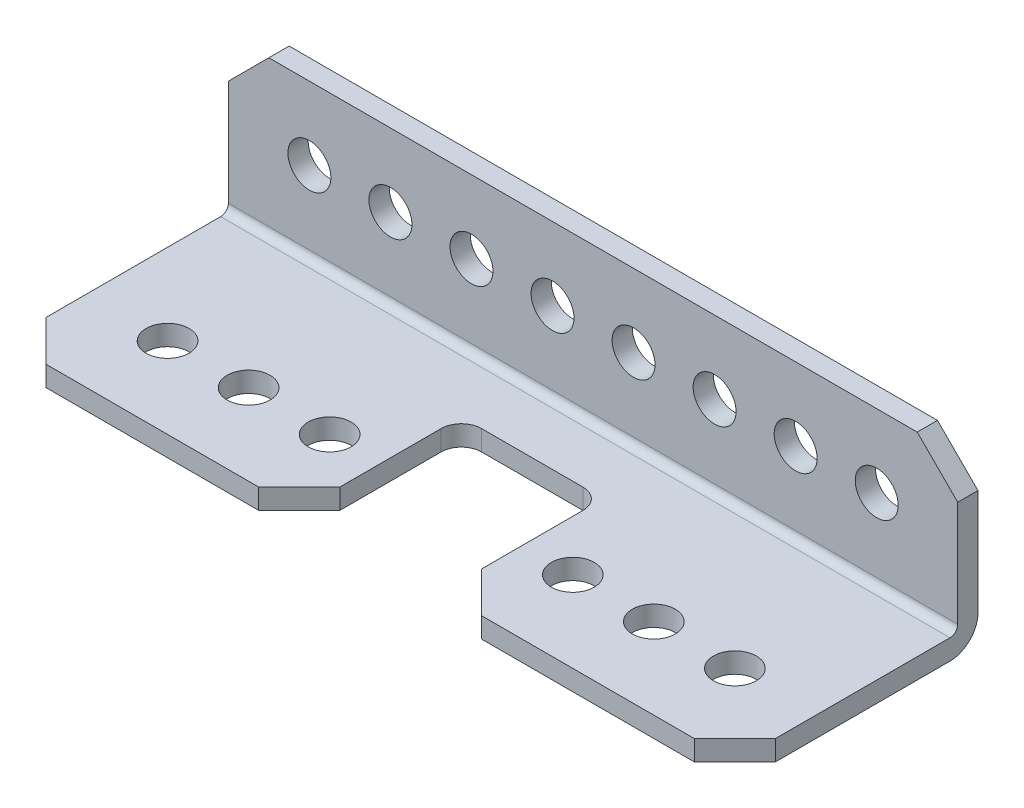
ISO-10303-21;
HEADER;
FILE_DESCRIPTION(('STEP AP214'),'2;1');
FILE_NAME('part.step','',(''),(''),'','','');
FILE_SCHEMA(('AUTOMOTIVE_DESIGN { 1 0 10303 214 1 1 1 1 }'));
ENDSEC;
DATA;
#1=APPLICATION_CONTEXT('core data for automotive mechanical design processes');
#2=APPLICATION_PROTOCOL_DEFINITION('international standard','automotive_design',2000,#1);
#3=PRODUCT_CONTEXT('',#1,'mechanical');
#4=PRODUCT('Part','Part','',(#3));
#5=PRODUCT_RELATED_PRODUCT_CATEGORY('part','',(#4));
#6=PRODUCT_DEFINITION_FORMATION('','',#4);
#7=PRODUCT_DEFINITION_CONTEXT('part definition',#1,'design');
#8=PRODUCT_DEFINITION('design','',#6,#7);
#9=PRODUCT_DEFINITION_SHAPE('','',#8);
#10=(LENGTH_UNIT() NAMED_UNIT(*) SI_UNIT(.MILLI.,.METRE.));
#11=(NAMED_UNIT(*) PLANE_ANGLE_UNIT() SI_UNIT($,.RADIAN.));
#12=(NAMED_UNIT(*) SI_UNIT($,.STERADIAN.) SOLID_ANGLE_UNIT());
#13=UNCERTAINTY_MEASURE_WITH_UNIT(LENGTH_MEASURE(1.E-05),#10,'distance_accuracy_value','');
#14=(GEOMETRIC_REPRESENTATION_CONTEXT(3) GLOBAL_UNCERTAINTY_ASSIGNED_CONTEXT((#13)) GLOBAL_UNIT_ASSIGNED_CONTEXT((#10,
#11,#12)) REPRESENTATION_CONTEXT('',''));
#15=CARTESIAN_POINT('',(0.,0.,0.));
#16=DIRECTION('',(0.,0.,1.));
#17=DIRECTION('',(1.,0.,0.));
#18=AXIS2_PLACEMENT_3D('',#15,#16,#17);
#19=CARTESIAN_POINT('',(-57.15,-12.065,0.));
#20=DIRECTION('',(0.,0.,1.));
#21=DIRECTION('',(1.,0.,0.));
#22=AXIS2_PLACEMENT_3D('',#19,#20,#21);
#23=PLANE('',#22);
#24=DIRECTION('',(0.707106781186548,-0.707106781186547,0.));
#25=VECTOR('',#24,1.);
#26=CARTESIAN_POINT('',(50.8,12.065,0.));
#27=LINE('',#26,#25);
#28=CARTESIAN_POINT('',(50.8,12.065,0.));
#29=VERTEX_POINT('',#28);
#30=CARTESIAN_POINT('',(57.15,5.71500000000001,0.));
#31=VERTEX_POINT('',#30);
#32=EDGE_CURVE('E155',#29,#31,#27,.T.);
#33=ORIENTED_EDGE('',*,*,#32,.T.);
#34=DIRECTION('',(0.,1.,0.));
#35=VECTOR('',#34,1.);
#36=CARTESIAN_POINT('',(57.15,12.065,0.));
#37=LINE('',#36,#35);
#38=CARTESIAN_POINT('',(57.15,-10.8458,0.));
#39=VERTEX_POINT('',#38);
#40=EDGE_CURVE('E149',#31,#39,#37,.F.);
#41=ORIENTED_EDGE('',*,*,#40,.T.);
#42=DIRECTION('',(1.,0.,0.));
#43=VECTOR('',#42,1.);
#44=CARTESIAN_POINT('',(57.15,-10.8458,0.));
#45=LINE('',#44,#43);
#46=CARTESIAN_POINT('',(-57.15,-10.8458,0.));
#47=VERTEX_POINT('',#46);
#48=EDGE_CURVE('E152',#47,#39,#45,.T.);
#49=ORIENTED_EDGE('',*,*,#48,.F.);
#50=DIRECTION('',(0.,1.,0.));
#51=VECTOR('',#50,1.);
#52=CARTESIAN_POINT('',(-57.15,12.065,0.));
#53=LINE('',#52,#51);
#54=CARTESIAN_POINT('',(-57.15,5.715,0.));
#55=VERTEX_POINT('',#54);
#56=EDGE_CURVE('E473',#47,#55,#53,.T.);
#57=ORIENTED_EDGE('',*,*,#56,.T.);
#58=DIRECTION('',(0.707106781186548,0.707106781186547,0.));
#59=VECTOR('',#58,1.);
#60=CARTESIAN_POINT('',(-57.15,5.715,0.));
#61=LINE('',#60,#59);
#62=CARTESIAN_POINT('',(-50.8,12.065,0.));
#63=VERTEX_POINT('',#62);
#64=EDGE_CURVE('E448',#55,#63,#61,.T.);
#65=ORIENTED_EDGE('',*,*,#64,.T.);
#66=DIRECTION('',(1.,0.,0.));
#67=VECTOR('',#66,1.);
#68=CARTESIAN_POINT('',(-57.15,12.065,0.));
#69=LINE('',#68,#67);
#70=EDGE_CURVE('E443',#63,#29,#69,.T.);
#71=ORIENTED_EDGE('',*,*,#70,.T.);
#72=EDGE_LOOP('',(#33,#41,#49,#57,#65,#71));
#73=FACE_BOUND('',#72,.T.);
#74=CARTESIAN_POINT('',(-44.45,0.634999999999998,0.));
#75=DIRECTION('',(0.,0.,1.));
#76=DIRECTION('',(1.,0.,0.));
#77=AXIS2_PLACEMENT_3D('',#74,#75,#76);
#78=CIRCLE('',#77,3.3655);
#79=CARTESIAN_POINT('',(-41.0845,0.634999999999998,0.));
#80=VERTEX_POINT('',#79);
#81=EDGE_CURVE('E159',#80,#80,#78,.T.);
#82=ORIENTED_EDGE('',*,*,#81,.T.);
#83=EDGE_LOOP('',(#82));
#84=FACE_BOUND('',#83,.T.);
#85=CARTESIAN_POINT('',(-31.75,0.634999999999998,0.));
#86=DIRECTION('',(0.,0.,1.));
#87=DIRECTION('',(1.,0.,0.));
#88=AXIS2_PLACEMENT_3D('',#85,#86,#87);
#89=CIRCLE('',#88,3.36549999999999);
#90=CARTESIAN_POINT('',(-28.3845,0.634999999999998,0.));
#91=VERTEX_POINT('',#90);
#92=EDGE_CURVE('E184',#91,#91,#89,.T.);
#93=ORIENTED_EDGE('',*,*,#92,.T.);
#94=EDGE_LOOP('',(#93));
#95=FACE_BOUND('',#94,.T.);
#96=CARTESIAN_POINT('',(-19.05,0.634999999999998,0.));
#97=DIRECTION('',(0.,0.,1.));
#98=DIRECTION('',(1.,0.,0.));
#99=AXIS2_PLACEMENT_3D('',#96,#97,#98);
#100=CIRCLE('',#99,3.3655);
#101=CARTESIAN_POINT('',(-15.6845,0.634999999999998,0.));
#102=VERTEX_POINT('',#101);
#103=EDGE_CURVE('E187',#102,#102,#100,.T.);
#104=ORIENTED_EDGE('',*,*,#103,.T.);
#105=EDGE_LOOP('',(#104));
#106=FACE_BOUND('',#105,.T.);
#107=CARTESIAN_POINT('',(-6.35,0.634999999999998,0.));
#108=DIRECTION('',(0.,0.,1.));
#109=DIRECTION('',(1.,0.,0.));
#110=AXIS2_PLACEMENT_3D('',#107,#108,#109);
#111=CIRCLE('',#110,3.3655);
#112=CARTESIAN_POINT('',(-2.9845,0.634999999999998,0.));
#113=VERTEX_POINT('',#112);
#114=EDGE_CURVE('E190',#113,#113,#111,.T.);
#115=ORIENTED_EDGE('',*,*,#114,.T.);
#116=EDGE_LOOP('',(#115));
#117=FACE_BOUND('',#116,.T.);
#118=CARTESIAN_POINT('',(6.35,0.634999999999998,0.));
#119=DIRECTION('',(0.,0.,1.));
#120=DIRECTION('',(1.,0.,0.));
#121=AXIS2_PLACEMENT_3D('',#118,#119,#120);
#122=CIRCLE('',#121,3.3655);
#123=CARTESIAN_POINT('',(9.7155,0.634999999999998,0.));
#124=VERTEX_POINT('',#123);
#125=EDGE_CURVE('E193',#124,#124,#122,.T.);
#126=ORIENTED_EDGE('',*,*,#125,.T.);
#127=EDGE_LOOP('',(#126));
#128=FACE_BOUND('',#127,.T.);
#129=CARTESIAN_POINT('',(19.05,0.634999999999998,0.));
#130=DIRECTION('',(0.,0.,1.));
#131=DIRECTION('',(1.,0.,0.));
#132=AXIS2_PLACEMENT_3D('',#129,#130,#131);
#133=CIRCLE('',#132,3.3655);
#134=CARTESIAN_POINT('',(22.4155,0.634999999999998,0.));
#135=VERTEX_POINT('',#134);
#136=EDGE_CURVE('E196',#135,#135,#133,.T.);
#137=ORIENTED_EDGE('',*,*,#136,.T.);
#138=EDGE_LOOP('',(#137));
#139=FACE_BOUND('',#138,.T.);
#140=CARTESIAN_POINT('',(31.75,0.634999999999998,0.));
#141=DIRECTION('',(0.,0.,1.));
#142=DIRECTION('',(1.,0.,0.));
#143=AXIS2_PLACEMENT_3D('',#140,#141,#142);
#144=CIRCLE('',#143,3.3655);
#145=CARTESIAN_POINT('',(35.1155,0.634999999999998,0.));
#146=VERTEX_POINT('',#145);
#147=EDGE_CURVE('E198',#146,#146,#144,.T.);
#148=ORIENTED_EDGE('',*,*,#147,.T.);
#149=EDGE_LOOP('',(#148));
#150=FACE_BOUND('',#149,.T.);
#151=CARTESIAN_POINT('',(44.45,0.634999999999998,0.));
#152=DIRECTION('',(0.,0.,1.));
#153=DIRECTION('',(1.,0.,0.));
#154=AXIS2_PLACEMENT_3D('',#151,#152,#153);
#155=CIRCLE('',#154,3.3655);
#156=CARTESIAN_POINT('',(47.8155,0.634999999999998,0.));
#157=VERTEX_POINT('',#156);
#158=EDGE_CURVE('E19',#157,#157,#155,.T.);
#159=ORIENTED_EDGE('',*,*,#158,.T.);
#160=EDGE_LOOP('',(#159));
#161=FACE_BOUND('',#160,.T.);
#162=ADVANCED_FACE('F16',(#73,#84,#95,#106,#117,#128,#139,#150,#161),#23,.F.);
#163=CARTESIAN_POINT('',(44.45,0.634999999999998,0.));
#164=DIRECTION('',(0.,0.,1.));
#165=DIRECTION('',(1.,0.,0.));
#166=AXIS2_PLACEMENT_3D('',#163,#164,#165);
#167=CYLINDRICAL_SURFACE('',#166,3.3655);
#168=CARTESIAN_POINT('',(44.45,0.634999999999998,3.175));
#169=DIRECTION('',(0.,0.,1.));
#170=DIRECTION('',(1.,0.,0.));
#171=AXIS2_PLACEMENT_3D('',#168,#169,#170);
#172=CIRCLE('',#171,3.3655);
#173=CARTESIAN_POINT('',(47.8155,0.634999999999998,3.175));
#174=VERTEX_POINT('',#173);
#175=EDGE_CURVE('E175',#174,#174,#172,.F.);
#176=ORIENTED_EDGE('',*,*,#175,.F.);
#177=EDGE_LOOP('',(#176));
#178=FACE_BOUND('',#177,.T.);
#179=ORIENTED_EDGE('',*,*,#158,.F.);
#180=EDGE_LOOP('',(#179));
#181=FACE_BOUND('',#180,.T.);
#182=ADVANCED_FACE('F206',(#178,#181),#167,.F.);
#183=CARTESIAN_POINT('',(31.75,0.634999999999998,0.));
#184=DIRECTION('',(0.,0.,1.));
#185=DIRECTION('',(1.,0.,0.));
#186=AXIS2_PLACEMENT_3D('',#183,#184,#185);
#187=CYLINDRICAL_SURFACE('',#186,3.3655);
#188=CARTESIAN_POINT('',(31.75,0.634999999999998,3.175));
#189=DIRECTION('',(0.,0.,1.));
#190=DIRECTION('',(1.,0.,0.));
#191=AXIS2_PLACEMENT_3D('',#188,#189,#190);
#192=CIRCLE('',#191,3.3655);
#193=CARTESIAN_POINT('',(35.1155,0.634999999999998,3.175));
#194=VERTEX_POINT('',#193);
#195=EDGE_CURVE('E178',#194,#194,#192,.F.);
#196=ORIENTED_EDGE('',*,*,#195,.F.);
#197=EDGE_LOOP('',(#196));
#198=FACE_BOUND('',#197,.T.);
#199=ORIENTED_EDGE('',*,*,#147,.F.);
#200=EDGE_LOOP('',(#199));
#201=FACE_BOUND('',#200,.T.);
#202=ADVANCED_FACE('F208',(#198,#201),#187,.F.);
#203=CARTESIAN_POINT('',(19.05,0.634999999999998,0.));
#204=DIRECTION('',(0.,0.,1.));
#205=DIRECTION('',(1.,0.,0.));
#206=AXIS2_PLACEMENT_3D('',#203,#204,#205);
#207=CYLINDRICAL_SURFACE('',#206,3.3655);
#208=CARTESIAN_POINT('',(19.05,0.634999999999998,3.175));
#209=DIRECTION('',(0.,0.,1.));
#210=DIRECTION('',(1.,0.,0.));
#211=AXIS2_PLACEMENT_3D('',#208,#209,#210);
#212=CIRCLE('',#211,3.3655);
#213=CARTESIAN_POINT('',(22.4155,0.634999999999998,3.175));
#214=VERTEX_POINT('',#213);
#215=EDGE_CURVE('E353',#214,#214,#212,.F.);
#216=ORIENTED_EDGE('',*,*,#215,.F.);
#217=EDGE_LOOP('',(#216));
#218=FACE_BOUND('',#217,.T.);
#219=ORIENTED_EDGE('',*,*,#136,.F.);
#220=EDGE_LOOP('',(#219));
#221=FACE_BOUND('',#220,.T.);
#222=ADVANCED_FACE('F215',(#218,#221),#207,.F.);
#223=CARTESIAN_POINT('',(6.35,0.634999999999998,0.));
#224=DIRECTION('',(0.,0.,1.));
#225=DIRECTION('',(1.,0.,0.));
#226=AXIS2_PLACEMENT_3D('',#223,#224,#225);
#227=CYLINDRICAL_SURFACE('',#226,3.3655);
#228=CARTESIAN_POINT('',(6.35,0.634999999999998,3.175));
#229=DIRECTION('',(0.,0.,1.));
#230=DIRECTION('',(1.,0.,0.));
#231=AXIS2_PLACEMENT_3D('',#228,#229,#230);
#232=CIRCLE('',#231,3.3655);
#233=CARTESIAN_POINT('',(9.7155,0.634999999999998,3.175));
#234=VERTEX_POINT('',#233);
#235=EDGE_CURVE('E357',#234,#234,#232,.F.);
#236=ORIENTED_EDGE('',*,*,#235,.F.);
#237=EDGE_LOOP('',(#236));
#238=FACE_BOUND('',#237,.T.);
#239=ORIENTED_EDGE('',*,*,#125,.F.);
#240=EDGE_LOOP('',(#239));
#241=FACE_BOUND('',#240,.T.);
#242=ADVANCED_FACE('F341',(#238,#241),#227,.F.);
#243=CARTESIAN_POINT('',(-6.35,0.634999999999998,0.));
#244=DIRECTION('',(0.,0.,1.));
#245=DIRECTION('',(1.,0.,0.));
#246=AXIS2_PLACEMENT_3D('',#243,#244,#245);
#247=CYLINDRICAL_SURFACE('',#246,3.3655);
#248=CARTESIAN_POINT('',(-6.35,0.634999999999998,3.175));
#249=DIRECTION('',(0.,0.,1.));
#250=DIRECTION('',(1.,0.,0.));
#251=AXIS2_PLACEMENT_3D('',#248,#249,#250);
#252=CIRCLE('',#251,3.3655);
#253=CARTESIAN_POINT('',(-2.9845,0.634999999999998,3.175));
#254=VERTEX_POINT('',#253);
#255=EDGE_CURVE('E360',#254,#254,#252,.F.);
#256=ORIENTED_EDGE('',*,*,#255,.F.);
#257=EDGE_LOOP('',(#256));
#258=FACE_BOUND('',#257,.T.);
#259=ORIENTED_EDGE('',*,*,#114,.F.);
#260=EDGE_LOOP('',(#259));
#261=FACE_BOUND('',#260,.T.);
#262=ADVANCED_FACE('F337',(#258,#261),#247,.F.);
#263=CARTESIAN_POINT('',(-19.05,0.634999999999998,0.));
#264=DIRECTION('',(0.,0.,1.));
#265=DIRECTION('',(1.,0.,0.));
#266=AXIS2_PLACEMENT_3D('',#263,#264,#265);
#267=CYLINDRICAL_SURFACE('',#266,3.3655);
#268=CARTESIAN_POINT('',(-19.05,0.634999999999998,3.175));
#269=DIRECTION('',(0.,0.,1.));
#270=DIRECTION('',(1.,0.,0.));
#271=AXIS2_PLACEMENT_3D('',#268,#269,#270);
#272=CIRCLE('',#271,3.3655);
#273=CARTESIAN_POINT('',(-15.6845,0.634999999999998,3.175));
#274=VERTEX_POINT('',#273);
#275=EDGE_CURVE('E366',#274,#274,#272,.F.);
#276=ORIENTED_EDGE('',*,*,#275,.F.);
#277=EDGE_LOOP('',(#276));
#278=FACE_BOUND('',#277,.T.);
#279=ORIENTED_EDGE('',*,*,#103,.F.);
#280=EDGE_LOOP('',(#279));
#281=FACE_BOUND('',#280,.T.);
#282=ADVANCED_FACE('F333',(#278,#281),#267,.F.);
#283=CARTESIAN_POINT('',(-31.75,0.634999999999998,0.));
#284=DIRECTION('',(0.,0.,1.));
#285=DIRECTION('',(1.,0.,0.));
#286=AXIS2_PLACEMENT_3D('',#283,#284,#285);
#287=CYLINDRICAL_SURFACE('',#286,3.36549999999999);
#288=CARTESIAN_POINT('',(-31.75,0.634999999999998,3.175));
#289=DIRECTION('',(0.,0.,1.));
#290=DIRECTION('',(1.,0.,0.));
#291=AXIS2_PLACEMENT_3D('',#288,#289,#290);
#292=CIRCLE('',#291,3.36549999999999);
#293=CARTESIAN_POINT('',(-28.3845,0.634999999999998,3.175));
#294=VERTEX_POINT('',#293);
#295=EDGE_CURVE('E369',#294,#294,#292,.F.);
#296=ORIENTED_EDGE('',*,*,#295,.F.);
#297=EDGE_LOOP('',(#296));
#298=FACE_BOUND('',#297,.T.);
#299=ORIENTED_EDGE('',*,*,#92,.F.);
#300=EDGE_LOOP('',(#299));
#301=FACE_BOUND('',#300,.T.);
#302=ADVANCED_FACE('F329',(#298,#301),#287,.F.);
#303=CARTESIAN_POINT('',(-44.45,0.634999999999998,0.));
#304=DIRECTION('',(0.,0.,1.));
#305=DIRECTION('',(1.,0.,0.));
#306=AXIS2_PLACEMENT_3D('',#303,#304,#305);
#307=CYLINDRICAL_SURFACE('',#306,3.3655);
#308=CARTESIAN_POINT('',(-44.45,0.634999999999998,3.175));
#309=DIRECTION('',(0.,0.,1.));
#310=DIRECTION('',(1.,0.,0.));
#311=AXIS2_PLACEMENT_3D('',#308,#309,#310);
#312=CIRCLE('',#311,3.3655);
#313=CARTESIAN_POINT('',(-41.0845,0.634999999999998,3.175));
#314=VERTEX_POINT('',#313);
#315=EDGE_CURVE('E372',#314,#314,#312,.F.);
#316=ORIENTED_EDGE('',*,*,#315,.F.);
#317=EDGE_LOOP('',(#316));
#318=FACE_BOUND('',#317,.T.);
#319=ORIENTED_EDGE('',*,*,#81,.F.);
#320=EDGE_LOOP('',(#319));
#321=FACE_BOUND('',#320,.T.);
#322=ADVANCED_FACE('F325',(#318,#321),#307,.F.);
#323=CARTESIAN_POINT('',(50.8,12.065,3.175));
#324=DIRECTION('',(-0.707106781186547,-0.707106781186548,0.));
#325=DIRECTION('',(0.707106781186548,-0.707106781186547,0.));
#326=AXIS2_PLACEMENT_3D('',#323,#324,#325);
#327=PLANE('',#326);
#328=DIRECTION('',(0.,0.,1.));
#329=VECTOR('',#328,1.);
#330=CARTESIAN_POINT('',(57.15,5.715,3.175));
#331=LINE('',#330,#329);
#332=CARTESIAN_POINT('',(57.15,5.715,3.175));
#333=VERTEX_POINT('',#332);
#334=EDGE_CURVE('E440',#31,#333,#331,.T.);
#335=ORIENTED_EDGE('',*,*,#334,.F.);
#336=ORIENTED_EDGE('',*,*,#32,.F.);
#337=DIRECTION('',(0.,0.,-1.));
#338=VECTOR('',#337,1.);
#339=CARTESIAN_POINT('',(50.8,12.065,3.175));
#340=LINE('',#339,#338);
#341=CARTESIAN_POINT('',(50.8,12.065,3.175));
#342=VERTEX_POINT('',#341);
#343=EDGE_CURVE('E445',#29,#342,#340,.F.);
#344=ORIENTED_EDGE('',*,*,#343,.T.);
#345=DIRECTION('',(-0.707106781186548,0.707106781186547,0.));
#346=VECTOR('',#345,1.);
#347=CARTESIAN_POINT('',(57.15,5.71500000000001,3.175));
#348=LINE('',#347,#346);
#349=EDGE_CURVE('E458',#333,#342,#348,.T.);
#350=ORIENTED_EDGE('',*,*,#349,.F.);
#351=EDGE_LOOP('',(#335,#336,#344,#350));
#352=FACE_BOUND('',#351,.T.);
#353=ADVANCED_FACE('F321',(#352),#327,.F.);
#354=CARTESIAN_POINT('',(-57.15,12.065,3.175));
#355=DIRECTION('',(0.,-1.,0.));
#356=DIRECTION('',(0.,0.,-1.));
#357=AXIS2_PLACEMENT_3D('',#354,#355,#356);
#358=PLANE('',#357);
#359=ORIENTED_EDGE('',*,*,#343,.F.);
#360=ORIENTED_EDGE('',*,*,#70,.F.);
#361=DIRECTION('',(0.,0.,1.));
#362=VECTOR('',#361,1.);
#363=CARTESIAN_POINT('',(-50.8,12.065,3.175));
#364=LINE('',#363,#362);
#365=CARTESIAN_POINT('',(-50.8,12.065,3.175));
#366=VERTEX_POINT('',#365);
#367=EDGE_CURVE('E450',#63,#366,#364,.T.);
#368=ORIENTED_EDGE('',*,*,#367,.T.);
#369=DIRECTION('',(1.,0.,0.));
#370=VECTOR('',#369,1.);
#371=CARTESIAN_POINT('',(-57.15,12.065,3.175));
#372=LINE('',#371,#370);
#373=EDGE_CURVE('E461',#342,#366,#372,.F.);
#374=ORIENTED_EDGE('',*,*,#373,.F.);
#375=EDGE_LOOP('',(#359,#360,#368,#374));
#376=FACE_BOUND('',#375,.T.);
#377=ADVANCED_FACE('F317',(#376),#358,.F.);
#378=CARTESIAN_POINT('',(-57.15,5.715,3.175));
#379=DIRECTION('',(0.707106781186547,-0.707106781186548,0.));
#380=DIRECTION('',(0.707106781186548,0.707106781186547,0.));
#381=AXIS2_PLACEMENT_3D('',#378,#379,#380);
#382=PLANE('',#381);
#383=ORIENTED_EDGE('',*,*,#367,.F.);
#384=ORIENTED_EDGE('',*,*,#64,.F.);
#385=DIRECTION('',(0.,0.,-1.));
#386=VECTOR('',#385,1.);
#387=CARTESIAN_POINT('',(-57.15,5.715,3.175));
#388=LINE('',#387,#386);
#389=CARTESIAN_POINT('',(-57.15,5.715,3.175));
#390=VERTEX_POINT('',#389);
#391=EDGE_CURVE('E169',#55,#390,#388,.F.);
#392=ORIENTED_EDGE('',*,*,#391,.T.);
#393=DIRECTION('',(-0.707106781186548,-0.707106781186547,0.));
#394=VECTOR('',#393,1.);
#395=CARTESIAN_POINT('',(-50.8,12.065,3.175));
#396=LINE('',#395,#394);
#397=EDGE_CURVE('E469',#366,#390,#396,.T.);
#398=ORIENTED_EDGE('',*,*,#397,.F.);
#399=EDGE_LOOP('',(#383,#384,#392,#398));
#400=FACE_BOUND('',#399,.T.);
#401=ADVANCED_FACE('F314',(#400),#382,.F.);
#402=CARTESIAN_POINT('',(57.15,-10.8458,4.3942));
#403=DIRECTION('',(1.,0.,0.));
#404=DIRECTION('',(0.,0.,-1.));
#405=AXIS2_PLACEMENT_3D('',#402,#403,#404);
#406=CYLINDRICAL_SURFACE('',#405,4.3942);
#407=DIRECTION('',(1.,0.,0.));
#408=VECTOR('',#407,1.);
#409=CARTESIAN_POINT('',(-57.15,-15.24,4.39419999999999));
#410=LINE('',#409,#408);
#411=CARTESIAN_POINT('',(57.15,-15.24,4.39419999999999));
#412=VERTEX_POINT('',#411);
#413=CARTESIAN_POINT('',(-57.15,-15.24,4.39419999999999));
#414=VERTEX_POINT('',#413);
#415=EDGE_CURVE('E377',#412,#414,#410,.F.);
#416=ORIENTED_EDGE('',*,*,#415,.T.);
#417=CARTESIAN_POINT('',(-57.15,-10.8458,4.3942));
#418=DIRECTION('',(1.,0.,0.));
#419=DIRECTION('',(0.,0.,-1.));
#420=AXIS2_PLACEMENT_3D('',#417,#418,#419);
#421=CIRCLE('',#420,4.3942);
#422=EDGE_CURVE('E168',#47,#414,#421,.F.);
#423=ORIENTED_EDGE('',*,*,#422,.F.);
#424=ORIENTED_EDGE('',*,*,#48,.T.);
#425=CARTESIAN_POINT('',(57.15,-10.8458,4.3942));
#426=DIRECTION('',(1.,0.,0.));
#427=DIRECTION('',(0.,0.,-1.));
#428=AXIS2_PLACEMENT_3D('',#425,#426,#427);
#429=CIRCLE('',#428,4.3942);
#430=EDGE_CURVE('E165',#39,#412,#429,.F.);
#431=ORIENTED_EDGE('',*,*,#430,.T.);
#432=EDGE_LOOP('',(#416,#423,#424,#431));
#433=FACE_BOUND('',#432,.T.);
#434=ADVANCED_FACE('F164',(#433),#406,.T.);
#435=CARTESIAN_POINT('',(-57.15,-12.065,3.175));
#436=DIRECTION('',(0.,0.,1.));
#437=DIRECTION('',(1.,0.,0.));
#438=AXIS2_PLACEMENT_3D('',#435,#436,#437);
#439=PLANE('',#438);
#440=DIRECTION('',(0.,1.,0.));
#441=VECTOR('',#440,1.);
#442=CARTESIAN_POINT('',(-57.15,-12.065,3.175));
#443=LINE('',#442,#441);
#444=CARTESIAN_POINT('',(-57.15,-10.8458,3.175));
#445=VERTEX_POINT('',#444);
#446=EDGE_CURVE('E378',#390,#445,#443,.F.);
#447=ORIENTED_EDGE('',*,*,#446,.T.);
#448=DIRECTION('',(1.,0.,0.));
#449=VECTOR('',#448,1.);
#450=CARTESIAN_POINT('',(57.15,-10.8458,3.175));
#451=LINE('',#450,#449);
#452=CARTESIAN_POINT('',(57.15,-10.8458,3.175));
#453=VERTEX_POINT('',#452);
#454=EDGE_CURVE('E392',#445,#453,#451,.T.);
#455=ORIENTED_EDGE('',*,*,#454,.T.);
#456=DIRECTION('',(0.,1.,0.));
#457=VECTOR('',#456,1.);
#458=CARTESIAN_POINT('',(57.15,-12.065,3.175));
#459=LINE('',#458,#457);
#460=EDGE_CURVE('E375',#453,#333,#459,.T.);
#461=ORIENTED_EDGE('',*,*,#460,.T.);
#462=ORIENTED_EDGE('',*,*,#349,.T.);
#463=ORIENTED_EDGE('',*,*,#373,.T.);
#464=ORIENTED_EDGE('',*,*,#397,.T.);
#465=EDGE_LOOP('',(#447,#455,#461,#462,#463,#464));
#466=FACE_BOUND('',#465,.T.);
#467=ORIENTED_EDGE('',*,*,#315,.T.);
#468=EDGE_LOOP('',(#467));
#469=FACE_BOUND('',#468,.T.);
#470=ORIENTED_EDGE('',*,*,#295,.T.);
#471=EDGE_LOOP('',(#470));
#472=FACE_BOUND('',#471,.T.);
#473=ORIENTED_EDGE('',*,*,#275,.T.);
#474=EDGE_LOOP('',(#473));
#475=FACE_BOUND('',#474,.T.);
#476=ORIENTED_EDGE('',*,*,#255,.T.);
#477=EDGE_LOOP('',(#476));
#478=FACE_BOUND('',#477,.T.);
#479=ORIENTED_EDGE('',*,*,#235,.T.);
#480=EDGE_LOOP('',(#479));
#481=FACE_BOUND('',#480,.T.);
#482=ORIENTED_EDGE('',*,*,#215,.T.);
#483=EDGE_LOOP('',(#482));
#484=FACE_BOUND('',#483,.T.);
#485=ORIENTED_EDGE('',*,*,#195,.T.);
#486=EDGE_LOOP('',(#485));
#487=FACE_BOUND('',#486,.T.);
#488=ORIENTED_EDGE('',*,*,#175,.T.);
#489=EDGE_LOOP('',(#488));
#490=FACE_BOUND('',#489,.T.);
#491=ADVANCED_FACE('F307',(#466,#469,#472,#475,#478,#481,#484,#487,#490),#439,.T.);
#492=CARTESIAN_POINT('',(-57.15,-15.2400000000001,38.1));
#493=DIRECTION('',(0.,1.,0.));
#494=DIRECTION('',(0.,0.,1.));
#495=AXIS2_PLACEMENT_3D('',#492,#493,#494);
#496=PLANE('',#495);
#497=DIRECTION('',(-0.707106781186547,0.,0.707106781186548));
#498=VECTOR('',#497,1.);
#499=CARTESIAN_POINT('',(-17.4625,-15.2400000000001,38.1));
#500=LINE('',#499,#498);
#501=CARTESIAN_POINT('',(-11.1125,-15.2400000000001,31.75));
#502=VERTEX_POINT('',#501);
#503=CARTESIAN_POINT('',(-17.4625,-15.2400000000001,38.1));
#504=VERTEX_POINT('',#503);
#505=EDGE_CURVE('E486',#502,#504,#500,.T.);
#506=ORIENTED_EDGE('',*,*,#505,.T.);
#507=DIRECTION('',(1.,0.,0.));
#508=VECTOR('',#507,1.);
#509=CARTESIAN_POINT('',(-57.15,-15.2400000000001,38.1));
#510=LINE('',#509,#508);
#511=CARTESIAN_POINT('',(-50.8,-15.2400000000001,38.1));
#512=VERTEX_POINT('',#511);
#513=EDGE_CURVE('E542',#504,#512,#510,.F.);
#514=ORIENTED_EDGE('',*,*,#513,.T.);
#515=DIRECTION('',(-0.707106781186548,0.,-0.707106781186548));
#516=VECTOR('',#515,1.);
#517=CARTESIAN_POINT('',(-57.15,-15.2400000000001,31.75));
#518=LINE('',#517,#516);
#519=CARTESIAN_POINT('',(-57.15,-15.2400000000001,31.75));
#520=VERTEX_POINT('',#519);
#521=EDGE_CURVE('E397',#512,#520,#518,.T.);
#522=ORIENTED_EDGE('',*,*,#521,.T.);
#523=DIRECTION('',(0.,0.,-1.));
#524=VECTOR('',#523,1.);
#525=CARTESIAN_POINT('',(-57.15,-15.2400000000001,3.17499999999999));
#526=LINE('',#525,#524);
#527=EDGE_CURVE('E531',#520,#414,#526,.T.);
#528=ORIENTED_EDGE('',*,*,#527,.T.);
#529=ORIENTED_EDGE('',*,*,#415,.F.);
#530=DIRECTION('',(0.,0.,1.));
#531=VECTOR('',#530,1.);
#532=CARTESIAN_POINT('',(57.15,-15.24,38.1));
#533=LINE('',#532,#531);
#534=CARTESIAN_POINT('',(57.15,-15.2400000000001,31.75));
#535=VERTEX_POINT('',#534);
#536=EDGE_CURVE('E174',#412,#535,#533,.T.);
#537=ORIENTED_EDGE('',*,*,#536,.T.);
#538=DIRECTION('',(-0.707106781186548,0.,0.707106781186547));
#539=VECTOR('',#538,1.);
#540=CARTESIAN_POINT('',(50.8,-15.2400000000001,38.1));
#541=LINE('',#540,#539);
#542=CARTESIAN_POINT('',(50.8,-15.2400000000001,38.1));
#543=VERTEX_POINT('',#542);
#544=EDGE_CURVE('E519',#535,#543,#541,.T.);
#545=ORIENTED_EDGE('',*,*,#544,.T.);
#546=DIRECTION('',(1.,0.,0.));
#547=VECTOR('',#546,1.);
#548=CARTESIAN_POINT('',(-57.15,-15.2400000000001,38.1));
#549=LINE('',#548,#547);
#550=CARTESIAN_POINT('',(17.4625,-15.2400000000001,38.1));
#551=VERTEX_POINT('',#550);
#552=EDGE_CURVE('E502',#543,#551,#549,.F.);
#553=ORIENTED_EDGE('',*,*,#552,.T.);
#554=DIRECTION('',(-0.707106781186547,0.,-0.707106781186548));
#555=VECTOR('',#554,1.);
#556=CARTESIAN_POINT('',(17.4625,-15.2400000000001,38.1));
#557=LINE('',#556,#555);
#558=CARTESIAN_POINT('',(11.1125,-15.2400000000001,31.75));
#559=VERTEX_POINT('',#558);
#560=EDGE_CURVE('E511',#551,#559,#557,.T.);
#561=ORIENTED_EDGE('',*,*,#560,.T.);
#562=DIRECTION('',(0.,0.,-1.));
#563=VECTOR('',#562,1.);
#564=CARTESIAN_POINT('',(11.1125,-15.2400000000001,38.1000000000001));
#565=LINE('',#564,#563);
#566=CARTESIAN_POINT('',(11.1125,-15.2400000000001,15.875));
#567=VERTEX_POINT('',#566);
#568=EDGE_CURVE('E516',#559,#567,#565,.T.);
#569=ORIENTED_EDGE('',*,*,#568,.T.);
#570=CARTESIAN_POINT('',(7.93750000000001,-15.24,15.875));
#571=DIRECTION('',(0.,1.,0.));
#572=DIRECTION('',(0.,0.,1.));
#573=AXIS2_PLACEMENT_3D('',#570,#571,#572);
#574=CIRCLE('',#573,3.175);
#575=CARTESIAN_POINT('',(7.93750000000001,-15.24,12.7));
#576=VERTEX_POINT('',#575);
#577=EDGE_CURVE('E383',#567,#576,#574,.T.);
#578=ORIENTED_EDGE('',*,*,#577,.T.);
#579=DIRECTION('',(1.,0.,0.));
#580=VECTOR('',#579,1.);
#581=CARTESIAN_POINT('',(-11.1125,-15.24,12.7));
#582=LINE('',#581,#580);
#583=CARTESIAN_POINT('',(-7.93750000000001,-15.24,12.7));
#584=VERTEX_POINT('',#583);
#585=EDGE_CURVE('E386',#576,#584,#582,.F.);
#586=ORIENTED_EDGE('',*,*,#585,.T.);
#587=CARTESIAN_POINT('',(-7.93750000000001,-15.24,15.875));
#588=DIRECTION('',(0.,1.,0.));
#589=DIRECTION('',(0.,0.,1.));
#590=AXIS2_PLACEMENT_3D('',#587,#588,#589);
#591=CIRCLE('',#590,3.175);
#592=CARTESIAN_POINT('',(-11.1125,-15.24,15.875));
#593=VERTEX_POINT('',#592);
#594=EDGE_CURVE('E379',#584,#593,#591,.T.);
#595=ORIENTED_EDGE('',*,*,#594,.T.);
#596=DIRECTION('',(0.,0.,1.));
#597=VECTOR('',#596,1.);
#598=CARTESIAN_POINT('',(-11.1125,-15.24,38.1000000000001));
#599=LINE('',#598,#597);
#600=EDGE_CURVE('E382',#593,#502,#599,.T.);
#601=ORIENTED_EDGE('',*,*,#600,.T.);
#602=EDGE_LOOP('',(#506,#514,#522,#528,#529,#537,#545,#553,#561,#569,#578,#586,#595,#601));
#603=FACE_BOUND('',#602,.T.);
#604=CARTESIAN_POINT('',(-44.45,-15.2400000000002,25.3999999999999));
#605=DIRECTION('',(0.,1.,0.));
#606=DIRECTION('',(0.,0.,1.));
#607=AXIS2_PLACEMENT_3D('',#604,#605,#606);
#608=CIRCLE('',#607,3.36549999999999);
#609=CARTESIAN_POINT('',(-44.45,-15.2400000000002,28.7654999999999));
#610=VERTEX_POINT('',#609);
#611=EDGE_CURVE('E409',#610,#610,#608,.T.);
#612=ORIENTED_EDGE('',*,*,#611,.T.);
#613=EDGE_LOOP('',(#612));
#614=FACE_BOUND('',#613,.T.);
#615=CARTESIAN_POINT('',(-31.75,-15.2400000000002,25.3999999999999));
#616=DIRECTION('',(0.,1.,0.));
#617=DIRECTION('',(0.,0.,1.));
#618=AXIS2_PLACEMENT_3D('',#615,#616,#617);
#619=CIRCLE('',#618,3.36549999999999);
#620=CARTESIAN_POINT('',(-31.75,-15.2400000000002,28.7654999999999));
#621=VERTEX_POINT('',#620);
#622=EDGE_CURVE('E406',#621,#621,#619,.T.);
#623=ORIENTED_EDGE('',*,*,#622,.T.);
#624=EDGE_LOOP('',(#623));
#625=FACE_BOUND('',#624,.T.);
#626=CARTESIAN_POINT('',(-19.05,-15.2400000000002,25.3999999999999));
#627=DIRECTION('',(0.,1.,0.));
#628=DIRECTION('',(0.,0.,1.));
#629=AXIS2_PLACEMENT_3D('',#626,#627,#628);
#630=CIRCLE('',#629,3.36549999999999);
#631=CARTESIAN_POINT('',(-19.05,-15.2400000000002,28.7654999999999));
#632=VERTEX_POINT('',#631);
#633=EDGE_CURVE('E403',#632,#632,#630,.T.);
#634=ORIENTED_EDGE('',*,*,#633,.T.);
#635=EDGE_LOOP('',(#634));
#636=FACE_BOUND('',#635,.T.);
#637=CARTESIAN_POINT('',(19.05,-15.2400000000002,25.3999999999999));
#638=DIRECTION('',(0.,1.,0.));
#639=DIRECTION('',(0.,0.,1.));
#640=AXIS2_PLACEMENT_3D('',#637,#638,#639);
#641=CIRCLE('',#640,3.36549999999999);
#642=CARTESIAN_POINT('',(19.05,-15.2400000000002,28.7654999999999));
#643=VERTEX_POINT('',#642);
#644=EDGE_CURVE('E400',#643,#643,#641,.T.);
#645=ORIENTED_EDGE('',*,*,#644,.T.);
#646=EDGE_LOOP('',(#645));
#647=FACE_BOUND('',#646,.T.);
#648=CARTESIAN_POINT('',(31.75,-15.2400000000002,25.3999999999999));
#649=DIRECTION('',(0.,1.,0.));
#650=DIRECTION('',(0.,0.,1.));
#651=AXIS2_PLACEMENT_3D('',#648,#649,#650);
#652=CIRCLE('',#651,3.36549999999999);
#653=CARTESIAN_POINT('',(31.75,-15.2400000000002,28.7654999999999));
#654=VERTEX_POINT('',#653);
#655=EDGE_CURVE('E396',#654,#654,#652,.T.);
#656=ORIENTED_EDGE('',*,*,#655,.T.);
#657=EDGE_LOOP('',(#656));
#658=FACE_BOUND('',#657,.T.);
#659=CARTESIAN_POINT('',(44.45,-15.2400000000002,25.3999999999999));
#660=DIRECTION('',(0.,1.,0.));
#661=DIRECTION('',(0.,0.,1.));
#662=AXIS2_PLACEMENT_3D('',#659,#660,#661);
#663=CIRCLE('',#662,3.36549999999999);
#664=CARTESIAN_POINT('',(44.45,-15.2400000000002,28.7654999999999));
#665=VERTEX_POINT('',#664);
#666=EDGE_CURVE('E393',#665,#665,#663,.T.);
#667=ORIENTED_EDGE('',*,*,#666,.T.);
#668=EDGE_LOOP('',(#667));
#669=FACE_BOUND('',#668,.T.);
#670=ADVANCED_FACE('F303',(#603,#614,#625,#636,#647,#658,#669),#496,.F.);
#671=CARTESIAN_POINT('',(-57.15,-15.2400000000001,38.1));
#672=DIRECTION('',(0.,0.,-1.));
#673=DIRECTION('',(0.,1.,0.));
#674=AXIS2_PLACEMENT_3D('',#671,#672,#673);
#675=PLANE('',#674);
#676=DIRECTION('',(0.,1.,0.));
#677=VECTOR('',#676,1.);
#678=CARTESIAN_POINT('',(-17.4625,-15.2400000000001,38.1));
#679=LINE('',#678,#677);
#680=CARTESIAN_POINT('',(-17.4625,-12.0650000000001,38.1));
#681=VERTEX_POINT('',#680);
#682=EDGE_CURVE('E490',#504,#681,#679,.T.);
#683=ORIENTED_EDGE('',*,*,#682,.T.);
#684=DIRECTION('',(1.,0.,0.));
#685=VECTOR('',#684,1.);
#686=CARTESIAN_POINT('',(-57.15,-12.0650000000001,38.1));
#687=LINE('',#686,#685);
#688=CARTESIAN_POINT('',(-50.8,-12.0650000000001,38.1));
#689=VERTEX_POINT('',#688);
#690=EDGE_CURVE('E412',#689,#681,#687,.T.);
#691=ORIENTED_EDGE('',*,*,#690,.F.);
#692=DIRECTION('',(0.,1.,0.));
#693=VECTOR('',#692,1.);
#694=CARTESIAN_POINT('',(-50.8,-15.2400000000001,38.1));
#695=LINE('',#694,#693);
#696=EDGE_CURVE('E549',#689,#512,#695,.F.);
#697=ORIENTED_EDGE('',*,*,#696,.T.);
#698=ORIENTED_EDGE('',*,*,#513,.F.);
#699=EDGE_LOOP('',(#683,#691,#697,#698));
#700=FACE_BOUND('',#699,.T.);
#701=ADVANCED_FACE('F299',(#700),#675,.F.);
#702=CARTESIAN_POINT('',(-17.4625,-15.2400000000001,38.1));
#703=DIRECTION('',(-0.707106781186548,0.,-0.707106781186547));
#704=DIRECTION('',(-0.707106781186547,0.,0.707106781186548));
#705=AXIS2_PLACEMENT_3D('',#702,#703,#704);
#706=PLANE('',#705);
#707=DIRECTION('',(0.,1.,0.));
#708=VECTOR('',#707,1.);
#709=CARTESIAN_POINT('',(-11.1125,12.065,31.75));
#710=LINE('',#709,#708);
#711=CARTESIAN_POINT('',(-11.1125,-12.0650000000001,31.75));
#712=VERTEX_POINT('',#711);
#713=EDGE_CURVE('E489',#502,#712,#710,.T.);
#714=ORIENTED_EDGE('',*,*,#713,.T.);
#715=DIRECTION('',(0.707106781186547,0.,-0.707106781186547));
#716=VECTOR('',#715,1.);
#717=CARTESIAN_POINT('',(-17.4625,-12.0650000000001,38.1));
#718=LINE('',#717,#716);
#719=EDGE_CURVE('E565',#681,#712,#718,.T.);
#720=ORIENTED_EDGE('',*,*,#719,.F.);
#721=ORIENTED_EDGE('',*,*,#682,.F.);
#722=ORIENTED_EDGE('',*,*,#505,.F.);
#723=EDGE_LOOP('',(#714,#720,#721,#722));
#724=FACE_BOUND('',#723,.T.);
#725=ADVANCED_FACE('F295',(#724),#706,.F.);
#726=CARTESIAN_POINT('',(-11.1125,12.065,38.1000000000001));
#727=DIRECTION('',(-1.,0.,0.));
#728=DIRECTION('',(0.,0.,1.));
#729=AXIS2_PLACEMENT_3D('',#726,#727,#728);
#730=PLANE('',#729);
#731=DIRECTION('',(0.,1.,0.));
#732=VECTOR('',#731,1.);
#733=CARTESIAN_POINT('',(-11.1125,12.0650000000001,15.8750000000001));
#734=LINE('',#733,#732);
#735=CARTESIAN_POINT('',(-11.1125,-12.065,15.875));
#736=VERTEX_POINT('',#735);
#737=EDGE_CURVE('E381',#593,#736,#734,.T.);
#738=ORIENTED_EDGE('',*,*,#737,.T.);
#739=DIRECTION('',(0.,0.,1.));
#740=VECTOR('',#739,1.);
#741=CARTESIAN_POINT('',(-11.1125,-12.0650000000001,38.1));
#742=LINE('',#741,#740);
#743=EDGE_CURVE('E417',#712,#736,#742,.F.);
#744=ORIENTED_EDGE('',*,*,#743,.F.);
#745=ORIENTED_EDGE('',*,*,#713,.F.);
#746=ORIENTED_EDGE('',*,*,#600,.F.);
#747=EDGE_LOOP('',(#738,#744,#745,#746));
#748=FACE_BOUND('',#747,.T.);
#749=ADVANCED_FACE('F291',(#748),#730,.F.);
#750=CARTESIAN_POINT('',(-7.93750000000001,12.0650000000001,15.8750000000001));
#751=DIRECTION('',(0.,1.,0.));
#752=DIRECTION('',(0.,0.,1.));
#753=AXIS2_PLACEMENT_3D('',#750,#751,#752);
#754=CYLINDRICAL_SURFACE('',#753,3.175);
#755=ORIENTED_EDGE('',*,*,#737,.F.);
#756=ORIENTED_EDGE('',*,*,#594,.F.);
#757=DIRECTION('',(0.,1.,0.));
#758=VECTOR('',#757,1.);
#759=CARTESIAN_POINT('',(-7.93750000000001,12.0650000000001,12.7000000000001));
#760=LINE('',#759,#758);
#761=CARTESIAN_POINT('',(-7.93750000000001,-12.065,12.7));
#762=VERTEX_POINT('',#761);
#763=EDGE_CURVE('E497',#584,#762,#760,.T.);
#764=ORIENTED_EDGE('',*,*,#763,.T.);
#765=CARTESIAN_POINT('',(-7.93750000000001,-12.065,15.875));
#766=DIRECTION('',(0.,1.,0.));
#767=DIRECTION('',(0.,0.,1.));
#768=AXIS2_PLACEMENT_3D('',#765,#766,#767);
#769=CIRCLE('',#768,3.175);
#770=EDGE_CURVE('E413',#736,#762,#769,.F.);
#771=ORIENTED_EDGE('',*,*,#770,.F.);
#772=EDGE_LOOP('',(#755,#756,#764,#771));
#773=FACE_BOUND('',#772,.T.);
#774=ADVANCED_FACE('F287',(#773),#754,.F.);
#775=CARTESIAN_POINT('',(-11.1125,12.0650000000001,12.7000000000001));
#776=DIRECTION('',(0.,0.,-1.));
#777=DIRECTION('',(0.,1.,0.));
#778=AXIS2_PLACEMENT_3D('',#775,#776,#777);
#779=PLANE('',#778);
#780=DIRECTION('',(0.,1.,0.));
#781=VECTOR('',#780,1.);
#782=CARTESIAN_POINT('',(7.93750000000001,12.0650000000001,12.7000000000001));
#783=LINE('',#782,#781);
#784=CARTESIAN_POINT('',(7.93750000000001,-12.065,12.7));
#785=VERTEX_POINT('',#784);
#786=EDGE_CURVE('E385',#576,#785,#783,.T.);
#787=ORIENTED_EDGE('',*,*,#786,.T.);
#788=DIRECTION('',(1.,0.,0.));
#789=VECTOR('',#788,1.);
#790=CARTESIAN_POINT('',(-57.15,-12.065,12.7));
#791=LINE('',#790,#789);
#792=EDGE_CURVE('E416',#762,#785,#791,.T.);
#793=ORIENTED_EDGE('',*,*,#792,.F.);
#794=ORIENTED_EDGE('',*,*,#763,.F.);
#795=ORIENTED_EDGE('',*,*,#585,.F.);
#796=EDGE_LOOP('',(#787,#793,#794,#795));
#797=FACE_BOUND('',#796,.T.);
#798=ADVANCED_FACE('F283',(#797),#779,.F.);
#799=CARTESIAN_POINT('',(7.93750000000001,12.0650000000001,15.8750000000001));
#800=DIRECTION('',(0.,1.,0.));
#801=DIRECTION('',(0.,0.,1.));
#802=AXIS2_PLACEMENT_3D('',#799,#800,#801);
#803=CYLINDRICAL_SURFACE('',#802,3.175);
#804=ORIENTED_EDGE('',*,*,#786,.F.);
#805=ORIENTED_EDGE('',*,*,#577,.F.);
#806=DIRECTION('',(0.,1.,0.));
#807=VECTOR('',#806,1.);
#808=CARTESIAN_POINT('',(11.1125,12.065,15.875));
#809=LINE('',#808,#807);
#810=CARTESIAN_POINT('',(11.1125,-12.065,15.875));
#811=VERTEX_POINT('',#810);
#812=EDGE_CURVE('E513',#567,#811,#809,.T.);
#813=ORIENTED_EDGE('',*,*,#812,.T.);
#814=CARTESIAN_POINT('',(7.93750000000001,-12.065,15.875));
#815=DIRECTION('',(0.,1.,0.));
#816=DIRECTION('',(0.,0.,1.));
#817=AXIS2_PLACEMENT_3D('',#814,#815,#816);
#818=CIRCLE('',#817,3.175);
#819=EDGE_CURVE('E418',#785,#811,#818,.F.);
#820=ORIENTED_EDGE('',*,*,#819,.F.);
#821=EDGE_LOOP('',(#804,#805,#813,#820));
#822=FACE_BOUND('',#821,.T.);
#823=ADVANCED_FACE('F279',(#822),#803,.F.);
#824=CARTESIAN_POINT('',(11.1125,12.065,38.1000000000001));
#825=DIRECTION('',(1.,0.,0.));
#826=DIRECTION('',(0.,0.,-1.));
#827=AXIS2_PLACEMENT_3D('',#824,#825,#826);
#828=PLANE('',#827);
#829=ORIENTED_EDGE('',*,*,#812,.F.);
#830=ORIENTED_EDGE('',*,*,#568,.F.);
#831=DIRECTION('',(0.,1.,0.));
#832=VECTOR('',#831,1.);
#833=CARTESIAN_POINT('',(11.1125,-15.2400000000001,31.75));
#834=LINE('',#833,#832);
#835=CARTESIAN_POINT('',(11.1125,-12.0650000000001,31.75));
#836=VERTEX_POINT('',#835);
#837=EDGE_CURVE('E503',#559,#836,#834,.T.);
#838=ORIENTED_EDGE('',*,*,#837,.T.);
#839=DIRECTION('',(0.,0.,1.));
#840=VECTOR('',#839,1.);
#841=CARTESIAN_POINT('',(11.1125,-12.0650000000001,38.1));
#842=LINE('',#841,#840);
#843=EDGE_CURVE('E421',#811,#836,#842,.T.);
#844=ORIENTED_EDGE('',*,*,#843,.F.);
#845=EDGE_LOOP('',(#829,#830,#838,#844));
#846=FACE_BOUND('',#845,.T.);
#847=ADVANCED_FACE('F275',(#846),#828,.F.);
#848=CARTESIAN_POINT('',(17.4625,-15.2400000000001,38.1));
#849=DIRECTION('',(0.707106781186548,0.,-0.707106781186547));
#850=DIRECTION('',(-0.707106781186547,0.,-0.707106781186548));
#851=AXIS2_PLACEMENT_3D('',#848,#849,#850);
#852=PLANE('',#851);
#853=ORIENTED_EDGE('',*,*,#837,.F.);
#854=ORIENTED_EDGE('',*,*,#560,.F.);
#855=DIRECTION('',(0.,1.,0.));
#856=VECTOR('',#855,1.);
#857=CARTESIAN_POINT('',(17.4625,-15.2400000000001,38.1));
#858=LINE('',#857,#856);
#859=CARTESIAN_POINT('',(17.4625,-12.0650000000001,38.1));
#860=VERTEX_POINT('',#859);
#861=EDGE_CURVE('E500',#551,#860,#858,.T.);
#862=ORIENTED_EDGE('',*,*,#861,.T.);
#863=DIRECTION('',(0.707106781186547,0.,0.707106781186547));
#864=VECTOR('',#863,1.);
#865=CARTESIAN_POINT('',(11.1125,-12.0650000000001,31.75));
#866=LINE('',#865,#864);
#867=EDGE_CURVE('E584',#836,#860,#866,.T.);
#868=ORIENTED_EDGE('',*,*,#867,.F.);
#869=EDGE_LOOP('',(#853,#854,#862,#868));
#870=FACE_BOUND('',#869,.T.);
#871=ADVANCED_FACE('F271',(#870),#852,.F.);
#872=CARTESIAN_POINT('',(-57.15,-15.2400000000001,38.1));
#873=DIRECTION('',(0.,0.,-1.));
#874=DIRECTION('',(0.,1.,0.));
#875=AXIS2_PLACEMENT_3D('',#872,#873,#874);
#876=PLANE('',#875);
#877=DIRECTION('',(0.,1.,0.));
#878=VECTOR('',#877,1.);
#879=CARTESIAN_POINT('',(50.8,-15.2400000000001,38.1));
#880=LINE('',#879,#878);
#881=CARTESIAN_POINT('',(50.8,-12.0650000000001,38.1));
#882=VERTEX_POINT('',#881);
#883=EDGE_CURVE('E508',#543,#882,#880,.T.);
#884=ORIENTED_EDGE('',*,*,#883,.T.);
#885=DIRECTION('',(1.,0.,0.));
#886=VECTOR('',#885,1.);
#887=CARTESIAN_POINT('',(-57.15,-12.0650000000001,38.1));
#888=LINE('',#887,#886);
#889=EDGE_CURVE('E587',#860,#882,#888,.T.);
#890=ORIENTED_EDGE('',*,*,#889,.F.);
#891=ORIENTED_EDGE('',*,*,#861,.F.);
#892=ORIENTED_EDGE('',*,*,#552,.F.);
#893=EDGE_LOOP('',(#884,#890,#891,#892));
#894=FACE_BOUND('',#893,.T.);
#895=ADVANCED_FACE('F267',(#894),#876,.F.);
#896=CARTESIAN_POINT('',(50.8,-15.2400000000001,38.1));
#897=DIRECTION('',(-0.707106781186547,0.,-0.707106781186548));
#898=DIRECTION('',(-0.707106781186548,0.,0.707106781186547));
#899=AXIS2_PLACEMENT_3D('',#896,#897,#898);
#900=PLANE('',#899);
#901=DIRECTION('',(0.,1.,0.));
#902=VECTOR('',#901,1.);
#903=CARTESIAN_POINT('',(57.15,-15.2400000000001,31.75));
#904=LINE('',#903,#902);
#905=CARTESIAN_POINT('',(57.15,-12.0650000000001,31.75));
#906=VERTEX_POINT('',#905);
#907=EDGE_CURVE('E390',#535,#906,#904,.T.);
#908=ORIENTED_EDGE('',*,*,#907,.T.);
#909=DIRECTION('',(0.707106781186548,0.,-0.707106781186547));
#910=VECTOR('',#909,1.);
#911=CARTESIAN_POINT('',(50.8,-12.0650000000001,38.1));
#912=LINE('',#911,#910);
#913=EDGE_CURVE('E524',#882,#906,#912,.T.);
#914=ORIENTED_EDGE('',*,*,#913,.F.);
#915=ORIENTED_EDGE('',*,*,#883,.F.);
#916=ORIENTED_EDGE('',*,*,#544,.F.);
#917=EDGE_LOOP('',(#908,#914,#915,#916));
#918=FACE_BOUND('',#917,.T.);
#919=ADVANCED_FACE('F264',(#918),#900,.F.);
#920=CARTESIAN_POINT('',(57.15,-15.2400000000001,38.1));
#921=DIRECTION('',(-1.,0.,0.));
#922=DIRECTION('',(0.,0.,1.));
#923=AXIS2_PLACEMENT_3D('',#920,#921,#922);
#924=PLANE('',#923);
#925=ORIENTED_EDGE('',*,*,#907,.F.);
#926=ORIENTED_EDGE('',*,*,#536,.F.);
#927=ORIENTED_EDGE('',*,*,#430,.F.);
#928=ORIENTED_EDGE('',*,*,#40,.F.);
#929=ORIENTED_EDGE('',*,*,#334,.T.);
#930=ORIENTED_EDGE('',*,*,#460,.F.);
#931=CARTESIAN_POINT('',(57.15,-10.8458,4.3942));
#932=DIRECTION('',(1.,0.,0.));
#933=DIRECTION('',(0.,0.,-1.));
#934=AXIS2_PLACEMENT_3D('',#931,#932,#933);
#935=CIRCLE('',#934,1.2192);
#936=CARTESIAN_POINT('',(57.15,-12.065,4.3942));
#937=VERTEX_POINT('',#936);
#938=EDGE_CURVE('E387',#453,#937,#935,.F.);
#939=ORIENTED_EDGE('',*,*,#938,.T.);
#940=DIRECTION('',(0.,0.,1.));
#941=VECTOR('',#940,1.);
#942=CARTESIAN_POINT('',(57.15,-12.0650000000001,38.1));
#943=LINE('',#942,#941);
#944=EDGE_CURVE('E520',#906,#937,#943,.F.);
#945=ORIENTED_EDGE('',*,*,#944,.F.);
#946=EDGE_LOOP('',(#925,#926,#927,#928,#929,#930,#939,#945));
#947=FACE_BOUND('',#946,.T.);
#948=ADVANCED_FACE('F173',(#947),#924,.F.);
#949=CARTESIAN_POINT('',(57.15,-10.8458,4.3942));
#950=DIRECTION('',(1.,0.,0.));
#951=DIRECTION('',(0.,0.,-1.));
#952=AXIS2_PLACEMENT_3D('',#949,#950,#951);
#953=CYLINDRICAL_SURFACE('',#952,1.2192);
#954=CARTESIAN_POINT('',(-57.15,-10.8458,4.3942));
#955=DIRECTION('',(1.,0.,0.));
#956=DIRECTION('',(0.,0.,-1.));
#957=AXIS2_PLACEMENT_3D('',#954,#955,#956);
#958=CIRCLE('',#957,1.2192);
#959=CARTESIAN_POINT('',(-57.15,-12.065,4.39419999999999));
#960=VERTEX_POINT('',#959);
#961=EDGE_CURVE('E389',#960,#445,#958,.T.);
#962=ORIENTED_EDGE('',*,*,#961,.F.);
#963=DIRECTION('',(1.,0.,0.));
#964=VECTOR('',#963,1.);
#965=CARTESIAN_POINT('',(-57.15,-12.065,4.39419999999999));
#966=LINE('',#965,#964);
#967=EDGE_CURVE('E523',#937,#960,#966,.F.);
#968=ORIENTED_EDGE('',*,*,#967,.F.);
#969=ORIENTED_EDGE('',*,*,#938,.F.);
#970=ORIENTED_EDGE('',*,*,#454,.F.);
#971=EDGE_LOOP('',(#962,#968,#969,#970));
#972=FACE_BOUND('',#971,.T.);
#973=ADVANCED_FACE('F258',(#972),#953,.F.);
#974=CARTESIAN_POINT('',(-57.15,-15.24,3.17499999999999));
#975=DIRECTION('',(1.,0.,0.));
#976=DIRECTION('',(0.,0.,-1.));
#977=AXIS2_PLACEMENT_3D('',#974,#975,#976);
#978=PLANE('',#977);
#979=DIRECTION('',(0.,1.,0.));
#980=VECTOR('',#979,1.);
#981=CARTESIAN_POINT('',(-57.15,-15.2400000000001,31.75));
#982=LINE('',#981,#980);
#983=CARTESIAN_POINT('',(-57.15,-12.0650000000001,31.75));
#984=VERTEX_POINT('',#983);
#985=EDGE_CURVE('E34',#520,#984,#982,.T.);
#986=ORIENTED_EDGE('',*,*,#985,.T.);
#987=DIRECTION('',(0.,0.,1.));
#988=VECTOR('',#987,1.);
#989=CARTESIAN_POINT('',(-57.15,-12.0650000000001,38.1));
#990=LINE('',#989,#988);
#991=EDGE_CURVE('E538',#960,#984,#990,.T.);
#992=ORIENTED_EDGE('',*,*,#991,.F.);
#993=ORIENTED_EDGE('',*,*,#961,.T.);
#994=ORIENTED_EDGE('',*,*,#446,.F.);
#995=ORIENTED_EDGE('',*,*,#391,.F.);
#996=ORIENTED_EDGE('',*,*,#56,.F.);
#997=ORIENTED_EDGE('',*,*,#422,.T.);
#998=ORIENTED_EDGE('',*,*,#527,.F.);
#999=EDGE_LOOP('',(#986,#992,#993,#994,#995,#996,#997,#998));
#1000=FACE_BOUND('',#999,.T.);
#1001=ADVANCED_FACE('F254',(#1000),#978,.F.);
#1002=CARTESIAN_POINT('',(-57.15,-15.2400000000001,31.75));
#1003=DIRECTION('',(0.707106781186548,0.,-0.707106781186548));
#1004=DIRECTION('',(-0.707106781186548,0.,-0.707106781186548));
#1005=AXIS2_PLACEMENT_3D('',#1002,#1003,#1004);
#1006=PLANE('',#1005);
#1007=ORIENTED_EDGE('',*,*,#696,.F.);
#1008=DIRECTION('',(0.707106781186547,0.,0.707106781186547));
#1009=VECTOR('',#1008,1.);
#1010=CARTESIAN_POINT('',(-57.15,-12.0650000000001,31.75));
#1011=LINE('',#1010,#1009);
#1012=EDGE_CURVE('E426',#984,#689,#1011,.T.);
#1013=ORIENTED_EDGE('',*,*,#1012,.F.);
#1014=ORIENTED_EDGE('',*,*,#985,.F.);
#1015=ORIENTED_EDGE('',*,*,#521,.F.);
#1016=EDGE_LOOP('',(#1007,#1013,#1014,#1015));
#1017=FACE_BOUND('',#1016,.T.);
#1018=ADVANCED_FACE('F250',(#1017),#1006,.F.);
#1019=CARTESIAN_POINT('',(44.45,-15.2400000000002,25.3999999999999));
#1020=DIRECTION('',(0.,1.,0.));
#1021=DIRECTION('',(0.,0.,1.));
#1022=AXIS2_PLACEMENT_3D('',#1019,#1020,#1021);
#1023=CYLINDRICAL_SURFACE('',#1022,3.36549999999999);
#1024=CARTESIAN_POINT('',(44.45,-12.0650000000001,25.3999999999999));
#1025=DIRECTION('',(0.,1.,0.));
#1026=DIRECTION('',(0.,0.,1.));
#1027=AXIS2_PLACEMENT_3D('',#1024,#1025,#1026);
#1028=CIRCLE('',#1027,3.36549999999999);
#1029=CARTESIAN_POINT('',(44.45,-12.0650000000001,28.7654999999999));
#1030=VERTEX_POINT('',#1029);
#1031=EDGE_CURVE('E422',#1030,#1030,#1028,.F.);
#1032=ORIENTED_EDGE('',*,*,#1031,.F.);
#1033=EDGE_LOOP('',(#1032));
#1034=FACE_BOUND('',#1033,.T.);
#1035=ORIENTED_EDGE('',*,*,#666,.F.);
#1036=EDGE_LOOP('',(#1035));
#1037=FACE_BOUND('',#1036,.T.);
#1038=ADVANCED_FACE('F246',(#1034,#1037),#1023,.F.);
#1039=CARTESIAN_POINT('',(31.75,-15.2400000000002,25.3999999999999));
#1040=DIRECTION('',(0.,1.,0.));
#1041=DIRECTION('',(0.,0.,1.));
#1042=AXIS2_PLACEMENT_3D('',#1039,#1040,#1041);
#1043=CYLINDRICAL_SURFACE('',#1042,3.36549999999999);
#1044=CARTESIAN_POINT('',(31.75,-12.0650000000001,25.3999999999999));
#1045=DIRECTION('',(0.,1.,0.));
#1046=DIRECTION('',(0.,0.,1.));
#1047=AXIS2_PLACEMENT_3D('',#1044,#1045,#1046);
#1048=CIRCLE('',#1047,3.36549999999999);
#1049=CARTESIAN_POINT('',(31.75,-12.0650000000001,28.7654999999999));
#1050=VERTEX_POINT('',#1049);
#1051=EDGE_CURVE('E425',#1050,#1050,#1048,.F.);
#1052=ORIENTED_EDGE('',*,*,#1051,.F.);
#1053=EDGE_LOOP('',(#1052));
#1054=FACE_BOUND('',#1053,.T.);
#1055=ORIENTED_EDGE('',*,*,#655,.F.);
#1056=EDGE_LOOP('',(#1055));
#1057=FACE_BOUND('',#1056,.T.);
#1058=ADVANCED_FACE('F242',(#1054,#1057),#1043,.F.);
#1059=CARTESIAN_POINT('',(19.05,-15.2400000000002,25.3999999999999));
#1060=DIRECTION('',(0.,1.,0.));
#1061=DIRECTION('',(0.,0.,1.));
#1062=AXIS2_PLACEMENT_3D('',#1059,#1060,#1061);
#1063=CYLINDRICAL_SURFACE('',#1062,3.36549999999999);
#1064=CARTESIAN_POINT('',(19.05,-12.0650000000001,25.3999999999999));
#1065=DIRECTION('',(0.,1.,0.));
#1066=DIRECTION('',(0.,0.,1.));
#1067=AXIS2_PLACEMENT_3D('',#1064,#1065,#1066);
#1068=CIRCLE('',#1067,3.36549999999999);
#1069=CARTESIAN_POINT('',(19.05,-12.0650000000001,28.7654999999999));
#1070=VERTEX_POINT('',#1069);
#1071=EDGE_CURVE('E429',#1070,#1070,#1068,.F.);
#1072=ORIENTED_EDGE('',*,*,#1071,.F.);
#1073=EDGE_LOOP('',(#1072));
#1074=FACE_BOUND('',#1073,.T.);
#1075=ORIENTED_EDGE('',*,*,#644,.F.);
#1076=EDGE_LOOP('',(#1075));
#1077=FACE_BOUND('',#1076,.T.);
#1078=ADVANCED_FACE('F238',(#1074,#1077),#1063,.F.);
#1079=CARTESIAN_POINT('',(-19.05,-15.2400000000002,25.3999999999999));
#1080=DIRECTION('',(0.,1.,0.));
#1081=DIRECTION('',(0.,0.,1.));
#1082=AXIS2_PLACEMENT_3D('',#1079,#1080,#1081);
#1083=CYLINDRICAL_SURFACE('',#1082,3.36549999999999);
#1084=CARTESIAN_POINT('',(-19.05,-12.0650000000001,25.3999999999999));
#1085=DIRECTION('',(0.,1.,0.));
#1086=DIRECTION('',(0.,0.,1.));
#1087=AXIS2_PLACEMENT_3D('',#1084,#1085,#1086);
#1088=CIRCLE('',#1087,3.36549999999999);
#1089=CARTESIAN_POINT('',(-19.05,-12.0650000000001,28.7654999999999));
#1090=VERTEX_POINT('',#1089);
#1091=EDGE_CURVE('E432',#1090,#1090,#1088,.F.);
#1092=ORIENTED_EDGE('',*,*,#1091,.F.);
#1093=EDGE_LOOP('',(#1092));
#1094=FACE_BOUND('',#1093,.T.);
#1095=ORIENTED_EDGE('',*,*,#633,.F.);
#1096=EDGE_LOOP('',(#1095));
#1097=FACE_BOUND('',#1096,.T.);
#1098=ADVANCED_FACE('F234',(#1094,#1097),#1083,.F.);
#1099=CARTESIAN_POINT('',(-31.75,-15.2400000000002,25.3999999999999));
#1100=DIRECTION('',(0.,1.,0.));
#1101=DIRECTION('',(0.,0.,1.));
#1102=AXIS2_PLACEMENT_3D('',#1099,#1100,#1101);
#1103=CYLINDRICAL_SURFACE('',#1102,3.36549999999999);
#1104=CARTESIAN_POINT('',(-31.75,-12.0650000000001,25.3999999999999));
#1105=DIRECTION('',(0.,1.,0.));
#1106=DIRECTION('',(0.,0.,1.));
#1107=AXIS2_PLACEMENT_3D('',#1104,#1105,#1106);
#1108=CIRCLE('',#1107,3.36549999999999);
#1109=CARTESIAN_POINT('',(-31.75,-12.0650000000001,28.7654999999999));
#1110=VERTEX_POINT('',#1109);
#1111=EDGE_CURVE('E25',#1110,#1110,#1108,.F.);
#1112=ORIENTED_EDGE('',*,*,#1111,.F.);
#1113=EDGE_LOOP('',(#1112));
#1114=FACE_BOUND('',#1113,.T.);
#1115=ORIENTED_EDGE('',*,*,#622,.F.);
#1116=EDGE_LOOP('',(#1115));
#1117=FACE_BOUND('',#1116,.T.);
#1118=ADVANCED_FACE('F227',(#1114,#1117),#1103,.F.);
#1119=CARTESIAN_POINT('',(-44.45,-15.2400000000002,25.3999999999999));
#1120=DIRECTION('',(0.,1.,0.));
#1121=DIRECTION('',(0.,0.,1.));
#1122=AXIS2_PLACEMENT_3D('',#1119,#1120,#1121);
#1123=CYLINDRICAL_SURFACE('',#1122,3.36549999999999);
#1124=CARTESIAN_POINT('',(-44.45,-12.0650000000001,25.3999999999999));
#1125=DIRECTION('',(0.,1.,0.));
#1126=DIRECTION('',(0.,0.,1.));
#1127=AXIS2_PLACEMENT_3D('',#1124,#1125,#1126);
#1128=CIRCLE('',#1127,3.36549999999999);
#1129=CARTESIAN_POINT('',(-44.45,-12.0650000000001,28.7654999999999));
#1130=VERTEX_POINT('',#1129);
#1131=EDGE_CURVE('E11',#1130,#1130,#1128,.F.);
#1132=ORIENTED_EDGE('',*,*,#1131,.F.);
#1133=EDGE_LOOP('',(#1132));
#1134=FACE_BOUND('',#1133,.T.);
#1135=ORIENTED_EDGE('',*,*,#611,.F.);
#1136=EDGE_LOOP('',(#1135));
#1137=FACE_BOUND('',#1136,.T.);
#1138=ADVANCED_FACE('F221',(#1134,#1137),#1123,.F.);
#1139=CARTESIAN_POINT('',(-57.15,-12.0650000000001,38.1));
#1140=DIRECTION('',(0.,1.,0.));
#1141=DIRECTION('',(0.,0.,1.));
#1142=AXIS2_PLACEMENT_3D('',#1139,#1140,#1141);
#1143=PLANE('',#1142);
#1144=ORIENTED_EDGE('',*,*,#1131,.T.);
#1145=EDGE_LOOP('',(#1144));
#1146=FACE_BOUND('',#1145,.T.);
#1147=ORIENTED_EDGE('',*,*,#1111,.T.);
#1148=EDGE_LOOP('',(#1147));
#1149=FACE_BOUND('',#1148,.T.);
#1150=ORIENTED_EDGE('',*,*,#1091,.T.);
#1151=EDGE_LOOP('',(#1150));
#1152=FACE_BOUND('',#1151,.T.);
#1153=ORIENTED_EDGE('',*,*,#1071,.T.);
#1154=EDGE_LOOP('',(#1153));
#1155=FACE_BOUND('',#1154,.T.);
#1156=ORIENTED_EDGE('',*,*,#1051,.T.);
#1157=EDGE_LOOP('',(#1156));
#1158=FACE_BOUND('',#1157,.T.);
#1159=ORIENTED_EDGE('',*,*,#1031,.T.);
#1160=EDGE_LOOP('',(#1159));
#1161=FACE_BOUND('',#1160,.T.);
#1162=ORIENTED_EDGE('',*,*,#991,.T.);
#1163=ORIENTED_EDGE('',*,*,#1012,.T.);
#1164=ORIENTED_EDGE('',*,*,#690,.T.);
#1165=ORIENTED_EDGE('',*,*,#719,.T.);
#1166=ORIENTED_EDGE('',*,*,#743,.T.);
#1167=ORIENTED_EDGE('',*,*,#770,.T.);
#1168=ORIENTED_EDGE('',*,*,#792,.T.);
#1169=ORIENTED_EDGE('',*,*,#819,.T.);
#1170=ORIENTED_EDGE('',*,*,#843,.T.);
#1171=ORIENTED_EDGE('',*,*,#867,.T.);
#1172=ORIENTED_EDGE('',*,*,#889,.T.);
#1173=ORIENTED_EDGE('',*,*,#913,.T.);
#1174=ORIENTED_EDGE('',*,*,#944,.T.);
#1175=ORIENTED_EDGE('',*,*,#967,.T.);
#1176=EDGE_LOOP('',(#1162,#1163,#1164,#1165,#1166,#1167,#1168,#1169,#1170,#1171,#1172,#1173,
#1174,#1175));
#1177=FACE_BOUND('',#1176,.T.);
#1178=ADVANCED_FACE('F219',(#1146,#1149,#1152,#1155,#1158,#1161,#1177),#1143,.T.);
#1179=CLOSED_SHELL('',(#162,#182,#202,#222,#242,#262,#282,#302,#322,#353,#377,#401,#434,#491,
#670,#701,#725,#749,#774,#798,#823,#847,#871,#895,#919,#948,#973,#1001,#1018,#1038,#1058,#1078,
#1098,#1118,#1138,#1178));
#1180=MANIFOLD_SOLID_BREP('B1',#1179);
#1181=ADVANCED_BREP_SHAPE_REPRESENTATION('',(#18,#1180),#14);
#1182=SHAPE_DEFINITION_REPRESENTATION(#9,#1181);
ENDSEC;
END-ISO-10303-21;
